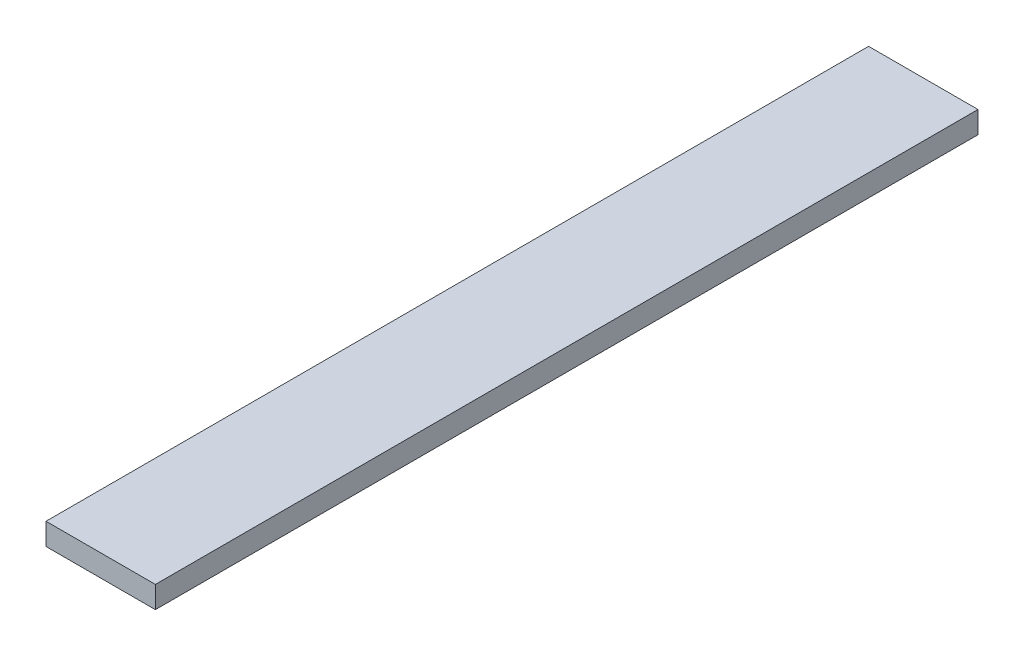
ISO-10303-21;
HEADER;
FILE_DESCRIPTION(('STEP AP214'),'2;1');
FILE_NAME('part.step','',(''),(''),'','','');
FILE_SCHEMA(('AUTOMOTIVE_DESIGN { 1 0 10303 214 1 1 1 1 }'));
ENDSEC;
DATA;
#1=APPLICATION_CONTEXT('core data for automotive mechanical design processes');
#2=APPLICATION_PROTOCOL_DEFINITION('international standard','automotive_design',2000,#1);
#3=PRODUCT_CONTEXT('',#1,'mechanical');
#4=PRODUCT('Part','Part','',(#3));
#5=PRODUCT_RELATED_PRODUCT_CATEGORY('part','',(#4));
#6=PRODUCT_DEFINITION_FORMATION('','',#4);
#7=PRODUCT_DEFINITION_CONTEXT('part definition',#1,'design');
#8=PRODUCT_DEFINITION('design','',#6,#7);
#9=PRODUCT_DEFINITION_SHAPE('','',#8);
#10=(LENGTH_UNIT() NAMED_UNIT(*) SI_UNIT(.MILLI.,.METRE.));
#11=(NAMED_UNIT(*) PLANE_ANGLE_UNIT() SI_UNIT($,.RADIAN.));
#12=(NAMED_UNIT(*) SI_UNIT($,.STERADIAN.) SOLID_ANGLE_UNIT());
#13=UNCERTAINTY_MEASURE_WITH_UNIT(LENGTH_MEASURE(1.E-05),#10,'distance_accuracy_value','');
#14=(GEOMETRIC_REPRESENTATION_CONTEXT(3) GLOBAL_UNCERTAINTY_ASSIGNED_CONTEXT((#13)) GLOBAL_UNIT_ASSIGNED_CONTEXT((#10,
#11,#12)) REPRESENTATION_CONTEXT('',''));
#15=CARTESIAN_POINT('',(0.,0.,0.));
#16=DIRECTION('',(0.,0.,1.));
#17=DIRECTION('',(1.,0.,0.));
#18=AXIS2_PLACEMENT_3D('',#15,#16,#17);
#19=CARTESIAN_POINT('',(0.,2.02999999999,0.));
#20=DIRECTION('',(0.,1.,0.));
#21=DIRECTION('',(-1.,0.,0.));
#22=AXIS2_PLACEMENT_3D('',#19,#20,#21);
#23=PLANE('',#22);
#24=DIRECTION('',(-1.,0.,0.));
#25=VECTOR('',#24,1.);
#26=CARTESIAN_POINT('',(0.,2.02999999999,0.195));
#27=LINE('',#26,#25);
#28=CARTESIAN_POINT('',(-0.125,2.02999999999,0.195));
#29=VERTEX_POINT('',#28);
#30=CARTESIAN_POINT('',(-0.375,2.02999999999,0.195));
#31=VERTEX_POINT('',#30);
#32=EDGE_CURVE('E19',#29,#31,#27,.T.);
#33=ORIENTED_EDGE('',*,*,#32,.F.);
#34=DIRECTION('',(0.,0.,1.));
#35=VECTOR('',#34,1.);
#36=CARTESIAN_POINT('',(-0.125,2.02999999999,0.195));
#37=LINE('',#36,#35);
#38=CARTESIAN_POINT('',(-0.125,2.02999999999,2.075));
#39=VERTEX_POINT('',#38);
#40=EDGE_CURVE('E68',#29,#39,#37,.T.);
#41=ORIENTED_EDGE('',*,*,#40,.T.);
#42=DIRECTION('',(-1.,0.,0.));
#43=VECTOR('',#42,1.);
#44=CARTESIAN_POINT('',(-0.375,2.02999999999,2.075));
#45=LINE('',#44,#43);
#46=CARTESIAN_POINT('',(-0.375,2.02999999999,2.075));
#47=VERTEX_POINT('',#46);
#48=EDGE_CURVE('E55',#39,#47,#45,.T.);
#49=ORIENTED_EDGE('',*,*,#48,.T.);
#50=DIRECTION('',(0.,0.,1.));
#51=VECTOR('',#50,1.);
#52=CARTESIAN_POINT('',(-0.375,2.02999999999,0.195));
#53=LINE('',#52,#51);
#54=EDGE_CURVE('E61',#47,#31,#53,.F.);
#55=ORIENTED_EDGE('',*,*,#54,.T.);
#56=EDGE_LOOP('',(#33,#41,#49,#55));
#57=FACE_BOUND('',#56,.T.);
#58=ADVANCED_FACE('F16',(#57),#23,.F.);
#59=CARTESIAN_POINT('',(-0.375,2.07999999999,0.195));
#60=DIRECTION('',(1.,0.,0.));
#61=DIRECTION('',(0.,1.,0.));
#62=AXIS2_PLACEMENT_3D('',#59,#60,#61);
#63=PLANE('',#62);
#64=DIRECTION('',(0.,1.,0.));
#65=VECTOR('',#64,1.);
#66=CARTESIAN_POINT('',(-0.375,2.07999999999,2.075));
#67=LINE('',#66,#65);
#68=CARTESIAN_POINT('',(-0.375,2.07999999999,2.075));
#69=VERTEX_POINT('',#68);
#70=EDGE_CURVE('E63',#47,#69,#67,.T.);
#71=ORIENTED_EDGE('',*,*,#70,.T.);
#72=DIRECTION('',(0.,0.,1.));
#73=VECTOR('',#72,1.);
#74=CARTESIAN_POINT('',(-0.375,2.07999999999,0.));
#75=LINE('',#74,#73);
#76=CARTESIAN_POINT('',(-0.375,2.07999999999,0.195));
#77=VERTEX_POINT('',#76);
#78=EDGE_CURVE('E82',#77,#69,#75,.T.);
#79=ORIENTED_EDGE('',*,*,#78,.F.);
#80=DIRECTION('',(0.,1.,0.));
#81=VECTOR('',#80,1.);
#82=CARTESIAN_POINT('',(-0.375,2.07999999999,0.195));
#83=LINE('',#82,#81);
#84=EDGE_CURVE('E66',#77,#31,#83,.F.);
#85=ORIENTED_EDGE('',*,*,#84,.T.);
#86=ORIENTED_EDGE('',*,*,#54,.F.);
#87=EDGE_LOOP('',(#71,#79,#85,#86));
#88=FACE_BOUND('',#87,.T.);
#89=ADVANCED_FACE('F62',(#88),#63,.F.);
#90=CARTESIAN_POINT('',(-0.375,2.07999999999,2.075));
#91=DIRECTION('',(0.,0.,-1.));
#92=DIRECTION('',(-1.,0.,0.));
#93=AXIS2_PLACEMENT_3D('',#90,#91,#92);
#94=PLANE('',#93);
#95=DIRECTION('',(0.,-1.,0.));
#96=VECTOR('',#95,1.);
#97=CARTESIAN_POINT('',(-0.125,2.07999999999,2.075));
#98=LINE('',#97,#96);
#99=CARTESIAN_POINT('',(-0.125,2.07999999999,2.075));
#100=VERTEX_POINT('',#99);
#101=EDGE_CURVE('E70',#39,#100,#98,.F.);
#102=ORIENTED_EDGE('',*,*,#101,.T.);
#103=DIRECTION('',(-1.,0.,0.));
#104=VECTOR('',#103,1.);
#105=CARTESIAN_POINT('',(0.,2.07999999999,2.075));
#106=LINE('',#105,#104);
#107=EDGE_CURVE('E74',#69,#100,#106,.F.);
#108=ORIENTED_EDGE('',*,*,#107,.F.);
#109=ORIENTED_EDGE('',*,*,#70,.F.);
#110=ORIENTED_EDGE('',*,*,#48,.F.);
#111=EDGE_LOOP('',(#102,#108,#109,#110));
#112=FACE_BOUND('',#111,.T.);
#113=ADVANCED_FACE('F72',(#112),#94,.F.);
#114=CARTESIAN_POINT('',(-0.125,2.07999999999,0.195));
#115=DIRECTION('',(-1.,0.,0.));
#116=DIRECTION('',(0.,-1.,0.));
#117=AXIS2_PLACEMENT_3D('',#114,#115,#116);
#118=PLANE('',#117);
#119=DIRECTION('',(0.,1.,0.));
#120=VECTOR('',#119,1.);
#121=CARTESIAN_POINT('',(-0.125,2.07999999999,0.195));
#122=LINE('',#121,#120);
#123=CARTESIAN_POINT('',(-0.125,2.07999999999,0.195));
#124=VERTEX_POINT('',#123);
#125=EDGE_CURVE('E34',#29,#124,#122,.T.);
#126=ORIENTED_EDGE('',*,*,#125,.T.);
#127=DIRECTION('',(0.,0.,1.));
#128=VECTOR('',#127,1.);
#129=CARTESIAN_POINT('',(-0.125,2.07999999999,0.));
#130=LINE('',#129,#128);
#131=EDGE_CURVE('E25',#100,#124,#130,.F.);
#132=ORIENTED_EDGE('',*,*,#131,.F.);
#133=ORIENTED_EDGE('',*,*,#101,.F.);
#134=ORIENTED_EDGE('',*,*,#40,.F.);
#135=EDGE_LOOP('',(#126,#132,#133,#134));
#136=FACE_BOUND('',#135,.T.);
#137=ADVANCED_FACE('F88',(#136),#118,.F.);
#138=CARTESIAN_POINT('',(-0.375,2.07999999999,0.195));
#139=DIRECTION('',(0.,0.,1.));
#140=DIRECTION('',(1.,0.,0.));
#141=AXIS2_PLACEMENT_3D('',#138,#139,#140);
#142=PLANE('',#141);
#143=ORIENTED_EDGE('',*,*,#84,.F.);
#144=DIRECTION('',(-1.,0.,0.));
#145=VECTOR('',#144,1.);
#146=CARTESIAN_POINT('',(0.,2.07999999999,0.195));
#147=LINE('',#146,#145);
#148=EDGE_CURVE('E11',#124,#77,#147,.T.);
#149=ORIENTED_EDGE('',*,*,#148,.F.);
#150=ORIENTED_EDGE('',*,*,#125,.F.);
#151=ORIENTED_EDGE('',*,*,#32,.T.);
#152=EDGE_LOOP('',(#143,#149,#150,#151));
#153=FACE_BOUND('',#152,.T.);
#154=ADVANCED_FACE('F90',(#153),#142,.F.);
#155=CARTESIAN_POINT('',(0.,2.07999999999,0.));
#156=DIRECTION('',(0.,1.,0.));
#157=DIRECTION('',(-1.,0.,0.));
#158=AXIS2_PLACEMENT_3D('',#155,#156,#157);
#159=PLANE('',#158);
#160=ORIENTED_EDGE('',*,*,#131,.T.);
#161=ORIENTED_EDGE('',*,*,#148,.T.);
#162=ORIENTED_EDGE('',*,*,#78,.T.);
#163=ORIENTED_EDGE('',*,*,#107,.T.);
#164=EDGE_LOOP('',(#160,#161,#162,#163));
#165=FACE_BOUND('',#164,.T.);
#166=ADVANCED_FACE('F87',(#165),#159,.T.);
#167=CLOSED_SHELL('',(#58,#89,#113,#137,#154,#166));
#168=MANIFOLD_SOLID_BREP('B1',#167);
#169=ADVANCED_BREP_SHAPE_REPRESENTATION('',(#18,#168),#14);
#170=SHAPE_DEFINITION_REPRESENTATION(#9,#169);
ENDSEC;
END-ISO-10303-21;
